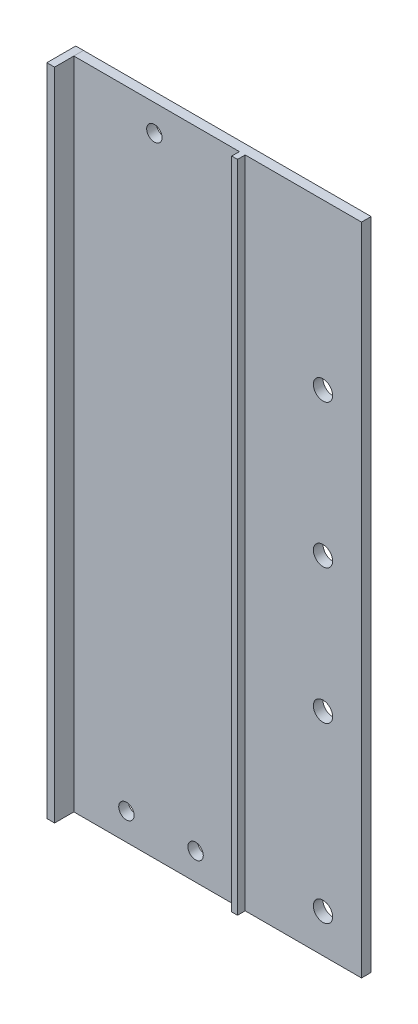
ISO-10303-21;
HEADER;
FILE_DESCRIPTION(('STEP AP214'),'2;1');
FILE_NAME('part.step','',(''),(''),'','','');
FILE_SCHEMA(('AUTOMOTIVE_DESIGN { 1 0 10303 214 1 1 1 1 }'));
ENDSEC;
DATA;
#1=APPLICATION_CONTEXT('core data for automotive mechanical design processes');
#2=APPLICATION_PROTOCOL_DEFINITION('international standard','automotive_design',2000,#1);
#3=PRODUCT_CONTEXT('',#1,'mechanical');
#4=PRODUCT('Part','Part','',(#3));
#5=PRODUCT_RELATED_PRODUCT_CATEGORY('part','',(#4));
#6=PRODUCT_DEFINITION_FORMATION('','',#4);
#7=PRODUCT_DEFINITION_CONTEXT('part definition',#1,'design');
#8=PRODUCT_DEFINITION('design','',#6,#7);
#9=PRODUCT_DEFINITION_SHAPE('','',#8);
#10=(LENGTH_UNIT() NAMED_UNIT(*) SI_UNIT(.MILLI.,.METRE.));
#11=(NAMED_UNIT(*) PLANE_ANGLE_UNIT() SI_UNIT($,.RADIAN.));
#12=(NAMED_UNIT(*) SI_UNIT($,.STERADIAN.) SOLID_ANGLE_UNIT());
#13=UNCERTAINTY_MEASURE_WITH_UNIT(LENGTH_MEASURE(1.E-05),#10,'distance_accuracy_value','');
#14=(GEOMETRIC_REPRESENTATION_CONTEXT(3) GLOBAL_UNCERTAINTY_ASSIGNED_CONTEXT((#13)) GLOBAL_UNIT_ASSIGNED_CONTEXT((#10,
#11,#12)) REPRESENTATION_CONTEXT('',''));
#15=CARTESIAN_POINT('',(0.,0.,0.));
#16=DIRECTION('',(0.,0.,1.));
#17=DIRECTION('',(1.,0.,0.));
#18=AXIS2_PLACEMENT_3D('',#15,#16,#17);
#19=CARTESIAN_POINT('',(-1.99999999999998,0.,7.5));
#20=DIRECTION('',(-1.,0.,0.));
#21=DIRECTION('',(0.,-1.,0.));
#22=AXIS2_PLACEMENT_3D('',#19,#20,#21);
#23=PLANE('',#22);
#24=DIRECTION('',(0.,1.,0.));
#25=VECTOR('',#24,1.);
#26=CARTESIAN_POINT('',(-1.99999999999998,0.,0.));
#27=LINE('',#26,#25);
#28=CARTESIAN_POINT('',(-1.99999999999998,0.,0.));
#29=VERTEX_POINT('',#28);
#30=CARTESIAN_POINT('',(-2.,170.,0.));
#31=VERTEX_POINT('',#30);
#32=EDGE_CURVE('E113',#29,#31,#27,.T.);
#33=ORIENTED_EDGE('',*,*,#32,.F.);
#34=DIRECTION('',(0.,0.,-1.));
#35=VECTOR('',#34,1.);
#36=CARTESIAN_POINT('',(-1.99999999999998,0.,7.5));
#37=LINE('',#36,#35);
#38=CARTESIAN_POINT('',(-1.99999999999998,0.,7.5));
#39=VERTEX_POINT('',#38);
#40=EDGE_CURVE('E12',#39,#29,#37,.T.);
#41=ORIENTED_EDGE('',*,*,#40,.F.);
#42=DIRECTION('',(0.,1.,0.));
#43=VECTOR('',#42,1.);
#44=CARTESIAN_POINT('',(-1.99999999999998,0.,7.5));
#45=LINE('',#44,#43);
#46=CARTESIAN_POINT('',(-2.,170.,7.5));
#47=VERTEX_POINT('',#46);
#48=EDGE_CURVE('E107',#39,#47,#45,.T.);
#49=ORIENTED_EDGE('',*,*,#48,.T.);
#50=DIRECTION('',(0.,0.,-1.));
#51=VECTOR('',#50,1.);
#52=CARTESIAN_POINT('',(-2.,170.,7.5));
#53=LINE('',#52,#51);
#54=EDGE_CURVE('E52',#47,#31,#53,.T.);
#55=ORIENTED_EDGE('',*,*,#54,.T.);
#56=EDGE_LOOP('',(#33,#41,#49,#55));
#57=FACE_BOUND('',#56,.T.);
#58=ADVANCED_FACE('F49',(#57),#23,.T.);
#59=CARTESIAN_POINT('',(0.,0.,7.5));
#60=DIRECTION('',(0.,-1.,0.));
#61=DIRECTION('',(1.,0.,0.));
#62=AXIS2_PLACEMENT_3D('',#59,#60,#61);
#63=PLANE('',#62);
#64=DIRECTION('',(-1.,0.,0.));
#65=VECTOR('',#64,1.);
#66=CARTESIAN_POINT('',(0.,0.,0.));
#67=LINE('',#66,#65);
#68=CARTESIAN_POINT('',(0.,0.,0.));
#69=VERTEX_POINT('',#68);
#70=EDGE_CURVE('E109',#69,#29,#67,.T.);
#71=ORIENTED_EDGE('',*,*,#70,.F.);
#72=DIRECTION('',(0.,0.,-1.));
#73=VECTOR('',#72,1.);
#74=CARTESIAN_POINT('',(0.,0.,7.5));
#75=LINE('',#74,#73);
#76=CARTESIAN_POINT('',(0.,0.,7.5));
#77=VERTEX_POINT('',#76);
#78=EDGE_CURVE('E58',#77,#69,#75,.T.);
#79=ORIENTED_EDGE('',*,*,#78,.F.);
#80=DIRECTION('',(-1.,0.,0.));
#81=VECTOR('',#80,1.);
#82=CARTESIAN_POINT('',(0.,0.,7.5));
#83=LINE('',#82,#81);
#84=EDGE_CURVE('E104',#77,#39,#83,.T.);
#85=ORIENTED_EDGE('',*,*,#84,.T.);
#86=ORIENTED_EDGE('',*,*,#40,.T.);
#87=EDGE_LOOP('',(#71,#79,#85,#86));
#88=FACE_BOUND('',#87,.T.);
#89=ADVANCED_FACE('F123',(#88),#63,.T.);
#90=CARTESIAN_POINT('',(0.,0.,7.5));
#91=DIRECTION('',(1.,0.,0.));
#92=DIRECTION('',(0.,0.,-1.));
#93=AXIS2_PLACEMENT_3D('',#90,#91,#92);
#94=PLANE('',#93);
#95=DIRECTION('',(0.,-1.,0.));
#96=VECTOR('',#95,1.);
#97=CARTESIAN_POINT('',(0.,0.,0.));
#98=LINE('',#97,#96);
#99=CARTESIAN_POINT('',(0.,170.,0.));
#100=VERTEX_POINT('',#99);
#101=EDGE_CURVE('E99',#100,#69,#98,.T.);
#102=ORIENTED_EDGE('',*,*,#101,.F.);
#103=DIRECTION('',(0.,0.,-1.));
#104=VECTOR('',#103,1.);
#105=CARTESIAN_POINT('',(0.,170.,7.5));
#106=LINE('',#105,#104);
#107=CARTESIAN_POINT('',(0.,170.,7.5));
#108=VERTEX_POINT('',#107);
#109=EDGE_CURVE('E94',#108,#100,#106,.T.);
#110=ORIENTED_EDGE('',*,*,#109,.F.);
#111=DIRECTION('',(0.,-1.,0.));
#112=VECTOR('',#111,1.);
#113=CARTESIAN_POINT('',(0.,0.,7.5));
#114=LINE('',#113,#112);
#115=EDGE_CURVE('E97',#108,#77,#114,.T.);
#116=ORIENTED_EDGE('',*,*,#115,.T.);
#117=ORIENTED_EDGE('',*,*,#78,.T.);
#118=EDGE_LOOP('',(#102,#110,#116,#117));
#119=FACE_BOUND('',#118,.T.);
#120=ADVANCED_FACE('F96',(#119),#94,.T.);
#121=CARTESIAN_POINT('',(0.,170.,7.5));
#122=DIRECTION('',(0.,1.,0.));
#123=DIRECTION('',(0.,0.,1.));
#124=AXIS2_PLACEMENT_3D('',#121,#122,#123);
#125=PLANE('',#124);
#126=DIRECTION('',(1.,0.,0.));
#127=VECTOR('',#126,1.);
#128=CARTESIAN_POINT('',(0.,170.,0.));
#129=LINE('',#128,#127);
#130=EDGE_CURVE('E116',#31,#100,#129,.T.);
#131=ORIENTED_EDGE('',*,*,#130,.F.);
#132=ORIENTED_EDGE('',*,*,#54,.F.);
#133=DIRECTION('',(1.,0.,0.));
#134=VECTOR('',#133,1.);
#135=CARTESIAN_POINT('',(0.,170.,7.5));
#136=LINE('',#135,#134);
#137=EDGE_CURVE('E103',#47,#108,#136,.T.);
#138=ORIENTED_EDGE('',*,*,#137,.T.);
#139=ORIENTED_EDGE('',*,*,#109,.T.);
#140=EDGE_LOOP('',(#131,#132,#138,#139));
#141=FACE_BOUND('',#140,.T.);
#142=ADVANCED_FACE('F106',(#141),#125,.T.);
#143=CARTESIAN_POINT('',(0.,0.,7.5));
#144=DIRECTION('',(0.,0.,-1.));
#145=DIRECTION('',(-1.,0.,0.));
#146=AXIS2_PLACEMENT_3D('',#143,#144,#145);
#147=PLANE('',#146);
#148=ORIENTED_EDGE('',*,*,#48,.F.);
#149=ORIENTED_EDGE('',*,*,#84,.F.);
#150=ORIENTED_EDGE('',*,*,#115,.F.);
#151=ORIENTED_EDGE('',*,*,#137,.F.);
#152=EDGE_LOOP('',(#148,#149,#150,#151));
#153=FACE_BOUND('',#152,.T.);
#154=ADVANCED_FACE('F102',(#153),#147,.F.);
#155=CARTESIAN_POINT('',(0.,0.,0.));
#156=DIRECTION('',(0.,0.,-1.));
#157=DIRECTION('',(-1.,0.,0.));
#158=AXIS2_PLACEMENT_3D('',#155,#156,#157);
#159=PLANE('',#158);
#160=ORIENTED_EDGE('',*,*,#32,.T.);
#161=ORIENTED_EDGE('',*,*,#130,.T.);
#162=ORIENTED_EDGE('',*,*,#101,.T.);
#163=ORIENTED_EDGE('',*,*,#70,.T.);
#164=EDGE_LOOP('',(#160,#161,#162,#163));
#165=FACE_BOUND('',#164,.T.);
#166=ADVANCED_FACE('F122',(#165),#159,.T.);
#167=CLOSED_SHELL('',(#58,#89,#120,#142,#154,#166));
#168=MANIFOLD_SOLID_BREP('B2',#167);
#169=CARTESIAN_POINT('',(0.,0.,2.5));
#170=DIRECTION('',(0.,0.,-1.));
#171=DIRECTION('',(-1.,0.,0.));
#172=AXIS2_PLACEMENT_3D('',#169,#170,#171);
#173=PLANE('',#172);
#174=CARTESIAN_POINT('',(13.6515942444387,7.02126150728162,2.5));
#175=DIRECTION('',(0.,0.,1.));
#176=DIRECTION('',(1.,0.,0.));
#177=AXIS2_PLACEMENT_3D('',#174,#175,#176);
#178=CIRCLE('',#177,2.);
#179=CARTESIAN_POINT('',(15.6515942444387,7.02126150728162,2.5));
#180=VERTEX_POINT('',#179);
#181=EDGE_CURVE('E311',#180,#180,#178,.T.);
#182=ORIENTED_EDGE('',*,*,#181,.F.);
#183=EDGE_LOOP('',(#182));
#184=FACE_BOUND('',#183,.T.);
#185=CARTESIAN_POINT('',(31.6132585895672,7.02126150728162,2.5));
#186=DIRECTION('',(0.,0.,1.));
#187=DIRECTION('',(1.,0.,0.));
#188=AXIS2_PLACEMENT_3D('',#185,#186,#187);
#189=CIRCLE('',#188,2.);
#190=CARTESIAN_POINT('',(33.6132585895672,7.02126150728162,2.5));
#191=VERTEX_POINT('',#190);
#192=EDGE_CURVE('E319',#191,#191,#189,.T.);
#193=ORIENTED_EDGE('',*,*,#192,.F.);
#194=EDGE_LOOP('',(#193));
#195=FACE_BOUND('',#194,.T.);
#196=CARTESIAN_POINT('',(20.913881882093,163.093745051864,2.5));
#197=DIRECTION('',(0.,0.,1.));
#198=DIRECTION('',(1.,0.,0.));
#199=AXIS2_PLACEMENT_3D('',#196,#197,#198);
#200=CIRCLE('',#199,2.);
#201=CARTESIAN_POINT('',(22.913881882093,163.093745051864,2.5));
#202=VERTEX_POINT('',#201);
#203=EDGE_CURVE('E327',#202,#202,#200,.T.);
#204=ORIENTED_EDGE('',*,*,#203,.F.);
#205=EDGE_LOOP('',(#204));
#206=FACE_BOUND('',#205,.T.);
#207=DIRECTION('',(0.,-1.,0.));
#208=VECTOR('',#207,1.);
#209=CARTESIAN_POINT('',(43.,170.,2.5));
#210=LINE('',#209,#208);
#211=CARTESIAN_POINT('',(43.,170.,2.5));
#212=VERTEX_POINT('',#211);
#213=CARTESIAN_POINT('',(43.,0.,2.5));
#214=VERTEX_POINT('',#213);
#215=EDGE_CURVE('E190',#212,#214,#210,.T.);
#216=ORIENTED_EDGE('',*,*,#215,.F.);
#217=DIRECTION('',(-1.,0.,0.));
#218=VECTOR('',#217,1.);
#219=CARTESIAN_POINT('',(0.,170.,2.5));
#220=LINE('',#219,#218);
#221=CARTESIAN_POINT('',(0.,170.,2.5));
#222=VERTEX_POINT('',#221);
#223=EDGE_CURVE('E347',#212,#222,#220,.T.);
#224=ORIENTED_EDGE('',*,*,#223,.T.);
#225=DIRECTION('',(0.,-1.,0.));
#226=VECTOR('',#225,1.);
#227=CARTESIAN_POINT('',(0.,0.,2.5));
#228=LINE('',#227,#226);
#229=CARTESIAN_POINT('',(0.,0.,2.5));
#230=VERTEX_POINT('',#229);
#231=EDGE_CURVE('E335',#222,#230,#228,.T.);
#232=ORIENTED_EDGE('',*,*,#231,.T.);
#233=DIRECTION('',(1.,0.,0.));
#234=VECTOR('',#233,1.);
#235=CARTESIAN_POINT('',(0.,0.,2.5));
#236=LINE('',#235,#234);
#237=EDGE_CURVE('E341',#230,#214,#236,.T.);
#238=ORIENTED_EDGE('',*,*,#237,.T.);
#239=EDGE_LOOP('',(#216,#224,#232,#238));
#240=FACE_BOUND('',#239,.T.);
#241=ADVANCED_FACE('F173',(#184,#195,#206,#240),#173,.F.);
#242=CARTESIAN_POINT('',(64.7,127.25,2.5));
#243=DIRECTION('',(0.,0.,1.));
#244=DIRECTION('',(1.,0.,0.));
#245=AXIS2_PLACEMENT_3D('',#242,#243,#244);
#246=CIRCLE('',#245,2.5);
#247=CARTESIAN_POINT('',(67.2,127.25,2.5));
#248=VERTEX_POINT('',#247);
#249=EDGE_CURVE('E270',#248,#248,#246,.T.);
#250=ORIENTED_EDGE('',*,*,#249,.F.);
#251=EDGE_LOOP('',(#250));
#252=FACE_BOUND('',#251,.T.);
#253=CARTESIAN_POINT('',(64.7,10.,2.5));
#254=DIRECTION('',(0.,0.,-1.));
#255=DIRECTION('',(-1.,0.,0.));
#256=AXIS2_PLACEMENT_3D('',#253,#254,#255);
#257=CIRCLE('',#256,2.5);
#258=CARTESIAN_POINT('',(62.2,10.,2.5));
#259=VERTEX_POINT('',#258);
#260=EDGE_CURVE('E306',#259,#259,#257,.T.);
#261=ORIENTED_EDGE('',*,*,#260,.T.);
#262=EDGE_LOOP('',(#261));
#263=FACE_BOUND('',#262,.T.);
#264=CARTESIAN_POINT('',(64.7,55.,2.5));
#265=DIRECTION('',(0.,0.,-1.));
#266=DIRECTION('',(-1.,0.,0.));
#267=AXIS2_PLACEMENT_3D('',#264,#265,#266);
#268=CIRCLE('',#267,2.5);
#269=CARTESIAN_POINT('',(62.2,55.,2.5));
#270=VERTEX_POINT('',#269);
#271=EDGE_CURVE('E302',#270,#270,#268,.T.);
#272=ORIENTED_EDGE('',*,*,#271,.T.);
#273=EDGE_LOOP('',(#272));
#274=FACE_BOUND('',#273,.T.);
#275=CARTESIAN_POINT('',(64.7,90.,2.5));
#276=DIRECTION('',(0.,0.,-1.));
#277=DIRECTION('',(-1.,0.,0.));
#278=AXIS2_PLACEMENT_3D('',#275,#276,#277);
#279=CIRCLE('',#278,2.5);
#280=CARTESIAN_POINT('',(62.2,90.,2.5));
#281=VERTEX_POINT('',#280);
#282=EDGE_CURVE('E291',#281,#281,#279,.T.);
#283=ORIENTED_EDGE('',*,*,#282,.T.);
#284=EDGE_LOOP('',(#283));
#285=FACE_BOUND('',#284,.T.);
#286=CARTESIAN_POINT('',(74.7,170.,2.5));
#287=VERTEX_POINT('',#286);
#288=CARTESIAN_POINT('',(44.5,170.,2.5));
#289=VERTEX_POINT('',#288);
#290=EDGE_CURVE('E198',#287,#289,#220,.T.);
#291=ORIENTED_EDGE('',*,*,#290,.T.);
#292=DIRECTION('',(0.,-1.,0.));
#293=VECTOR('',#292,1.);
#294=CARTESIAN_POINT('',(44.5,170.,2.5));
#295=LINE('',#294,#293);
#296=CARTESIAN_POINT('',(44.5,0.,2.5));
#297=VERTEX_POINT('',#296);
#298=EDGE_CURVE('E245',#289,#297,#295,.T.);
#299=ORIENTED_EDGE('',*,*,#298,.T.);
#300=CARTESIAN_POINT('',(74.7,0.,2.5));
#301=VERTEX_POINT('',#300);
#302=EDGE_CURVE('E339',#297,#301,#236,.T.);
#303=ORIENTED_EDGE('',*,*,#302,.T.);
#304=DIRECTION('',(0.,1.,0.));
#305=VECTOR('',#304,1.);
#306=CARTESIAN_POINT('',(74.7,0.,2.5));
#307=LINE('',#306,#305);
#308=EDGE_CURVE('E344',#301,#287,#307,.T.);
#309=ORIENTED_EDGE('',*,*,#308,.T.);
#310=EDGE_LOOP('',(#291,#299,#303,#309));
#311=FACE_BOUND('',#310,.T.);
#312=ADVANCED_FACE('F390',(#252,#263,#274,#285,#311),#173,.F.);
#313=CARTESIAN_POINT('',(0.,0.,0.));
#314=DIRECTION('',(0.,0.,-1.));
#315=DIRECTION('',(-1.,0.,0.));
#316=AXIS2_PLACEMENT_3D('',#313,#314,#315);
#317=PLANE('',#316);
#318=CARTESIAN_POINT('',(64.7,127.25,0.));
#319=DIRECTION('',(0.,0.,-1.));
#320=DIRECTION('',(-1.,0.,0.));
#321=AXIS2_PLACEMENT_3D('',#318,#319,#320);
#322=CIRCLE('',#321,2.5);
#323=CARTESIAN_POINT('',(62.2,127.25,0.));
#324=VERTEX_POINT('',#323);
#325=EDGE_CURVE('E177',#324,#324,#322,.T.);
#326=ORIENTED_EDGE('',*,*,#325,.F.);
#327=EDGE_LOOP('',(#326));
#328=FACE_BOUND('',#327,.T.);
#329=CARTESIAN_POINT('',(64.7,10.,0.));
#330=DIRECTION('',(0.,0.,-1.));
#331=DIRECTION('',(-1.,0.,0.));
#332=AXIS2_PLACEMENT_3D('',#329,#330,#331);
#333=CIRCLE('',#332,2.5);
#334=CARTESIAN_POINT('',(62.2,10.,0.));
#335=VERTEX_POINT('',#334);
#336=EDGE_CURVE('E287',#335,#335,#333,.T.);
#337=ORIENTED_EDGE('',*,*,#336,.F.);
#338=EDGE_LOOP('',(#337));
#339=FACE_BOUND('',#338,.T.);
#340=CARTESIAN_POINT('',(64.7,55.,0.));
#341=DIRECTION('',(0.,0.,-1.));
#342=DIRECTION('',(-1.,0.,0.));
#343=AXIS2_PLACEMENT_3D('',#340,#341,#342);
#344=CIRCLE('',#343,2.5);
#345=CARTESIAN_POINT('',(62.2,55.,0.));
#346=VERTEX_POINT('',#345);
#347=EDGE_CURVE('E292',#346,#346,#344,.T.);
#348=ORIENTED_EDGE('',*,*,#347,.F.);
#349=EDGE_LOOP('',(#348));
#350=FACE_BOUND('',#349,.T.);
#351=CARTESIAN_POINT('',(64.7,90.,0.));
#352=DIRECTION('',(0.,0.,-1.));
#353=DIRECTION('',(-1.,0.,0.));
#354=AXIS2_PLACEMENT_3D('',#351,#352,#353);
#355=CIRCLE('',#354,2.5);
#356=CARTESIAN_POINT('',(62.2,90.,0.));
#357=VERTEX_POINT('',#356);
#358=EDGE_CURVE('E280',#357,#357,#355,.T.);
#359=ORIENTED_EDGE('',*,*,#358,.F.);
#360=EDGE_LOOP('',(#359));
#361=FACE_BOUND('',#360,.T.);
#362=CARTESIAN_POINT('',(31.6132585895672,7.02126150728162,0.));
#363=DIRECTION('',(0.,0.,1.));
#364=DIRECTION('',(1.,0.,0.));
#365=AXIS2_PLACEMENT_3D('',#362,#363,#364);
#366=CIRCLE('',#365,2.);
#367=CARTESIAN_POINT('',(33.6132585895672,7.02126150728162,0.));
#368=VERTEX_POINT('',#367);
#369=EDGE_CURVE('E315',#368,#368,#366,.T.);
#370=ORIENTED_EDGE('',*,*,#369,.T.);
#371=EDGE_LOOP('',(#370));
#372=FACE_BOUND('',#371,.T.);
#373=DIRECTION('',(0.,-1.,0.));
#374=VECTOR('',#373,1.);
#375=CARTESIAN_POINT('',(0.,0.,0.));
#376=LINE('',#375,#374);
#377=CARTESIAN_POINT('',(0.,170.,0.));
#378=VERTEX_POINT('',#377);
#379=CARTESIAN_POINT('',(0.,0.,0.));
#380=VERTEX_POINT('',#379);
#381=EDGE_CURVE('E331',#378,#380,#376,.T.);
#382=ORIENTED_EDGE('',*,*,#381,.F.);
#383=DIRECTION('',(-1.,0.,0.));
#384=VECTOR('',#383,1.);
#385=CARTESIAN_POINT('',(0.,170.,0.));
#386=LINE('',#385,#384);
#387=CARTESIAN_POINT('',(74.7,170.,0.));
#388=VERTEX_POINT('',#387);
#389=EDGE_CURVE('E340',#388,#378,#386,.T.);
#390=ORIENTED_EDGE('',*,*,#389,.F.);
#391=DIRECTION('',(0.,1.,0.));
#392=VECTOR('',#391,1.);
#393=CARTESIAN_POINT('',(74.7,0.,0.));
#394=LINE('',#393,#392);
#395=CARTESIAN_POINT('',(74.7,0.,0.));
#396=VERTEX_POINT('',#395);
#397=EDGE_CURVE('E357',#396,#388,#394,.T.);
#398=ORIENTED_EDGE('',*,*,#397,.F.);
#399=DIRECTION('',(1.,0.,0.));
#400=VECTOR('',#399,1.);
#401=CARTESIAN_POINT('',(0.,0.,0.));
#402=LINE('',#401,#400);
#403=EDGE_CURVE('E354',#380,#396,#402,.T.);
#404=ORIENTED_EDGE('',*,*,#403,.F.);
#405=EDGE_LOOP('',(#382,#390,#398,#404));
#406=FACE_BOUND('',#405,.T.);
#407=CARTESIAN_POINT('',(20.913881882093,163.093745051864,0.));
#408=DIRECTION('',(0.,0.,1.));
#409=DIRECTION('',(1.,0.,0.));
#410=AXIS2_PLACEMENT_3D('',#407,#408,#409);
#411=CIRCLE('',#410,2.);
#412=CARTESIAN_POINT('',(22.913881882093,163.093745051864,0.));
#413=VERTEX_POINT('',#412);
#414=EDGE_CURVE('E323',#413,#413,#411,.T.);
#415=ORIENTED_EDGE('',*,*,#414,.T.);
#416=EDGE_LOOP('',(#415));
#417=FACE_BOUND('',#416,.T.);
#418=CARTESIAN_POINT('',(13.6515942444387,7.02126150728162,0.));
#419=DIRECTION('',(0.,0.,1.));
#420=DIRECTION('',(1.,0.,0.));
#421=AXIS2_PLACEMENT_3D('',#418,#419,#420);
#422=CIRCLE('',#421,2.);
#423=CARTESIAN_POINT('',(15.6515942444387,7.02126150728162,0.));
#424=VERTEX_POINT('',#423);
#425=EDGE_CURVE('E310',#424,#424,#422,.T.);
#426=ORIENTED_EDGE('',*,*,#425,.T.);
#427=EDGE_LOOP('',(#426));
#428=FACE_BOUND('',#427,.T.);
#429=ADVANCED_FACE('F382',(#328,#339,#350,#361,#372,#406,#417,#428),#317,.T.);
#430=CARTESIAN_POINT('',(0.,0.,2.5));
#431=DIRECTION('',(1.,0.,0.));
#432=DIRECTION('',(0.,0.,-1.));
#433=AXIS2_PLACEMENT_3D('',#430,#431,#432);
#434=PLANE('',#433);
#435=ORIENTED_EDGE('',*,*,#381,.T.);
#436=DIRECTION('',(0.,0.,-1.));
#437=VECTOR('',#436,1.);
#438=CARTESIAN_POINT('',(0.,0.,2.5));
#439=LINE('',#438,#437);
#440=EDGE_CURVE('E47',#230,#380,#439,.T.);
#441=ORIENTED_EDGE('',*,*,#440,.F.);
#442=ORIENTED_EDGE('',*,*,#231,.F.);
#443=DIRECTION('',(0.,0.,-1.));
#444=VECTOR('',#443,1.);
#445=CARTESIAN_POINT('',(0.,170.,2.5));
#446=LINE('',#445,#444);
#447=EDGE_CURVE('E350',#222,#378,#446,.T.);
#448=ORIENTED_EDGE('',*,*,#447,.T.);
#449=EDGE_LOOP('',(#435,#441,#442,#448));
#450=FACE_BOUND('',#449,.T.);
#451=ADVANCED_FACE('F175',(#450),#434,.F.);
#452=CARTESIAN_POINT('',(0.,0.,2.5));
#453=DIRECTION('',(0.,1.,0.));
#454=DIRECTION('',(0.,0.,1.));
#455=AXIS2_PLACEMENT_3D('',#452,#453,#454);
#456=PLANE('',#455);
#457=ORIENTED_EDGE('',*,*,#403,.T.);
#458=DIRECTION('',(0.,0.,-1.));
#459=VECTOR('',#458,1.);
#460=CARTESIAN_POINT('',(74.7,0.,2.5));
#461=LINE('',#460,#459);
#462=EDGE_CURVE('E183',#301,#396,#461,.T.);
#463=ORIENTED_EDGE('',*,*,#462,.F.);
#464=ORIENTED_EDGE('',*,*,#302,.F.);
#465=DIRECTION('',(0.,0.,-1.));
#466=VECTOR('',#465,1.);
#467=CARTESIAN_POINT('',(44.5,0.,4.5));
#468=LINE('',#467,#466);
#469=CARTESIAN_POINT('',(44.5,0.,4.5));
#470=VERTEX_POINT('',#469);
#471=EDGE_CURVE('E249',#470,#297,#468,.T.);
#472=ORIENTED_EDGE('',*,*,#471,.F.);
#473=DIRECTION('',(1.,0.,0.));
#474=VECTOR('',#473,1.);
#475=CARTESIAN_POINT('',(43.,0.,4.5));
#476=LINE('',#475,#474);
#477=CARTESIAN_POINT('',(43.,0.,4.5));
#478=VERTEX_POINT('',#477);
#479=EDGE_CURVE('E257',#478,#470,#476,.T.);
#480=ORIENTED_EDGE('',*,*,#479,.F.);
#481=DIRECTION('',(0.,0.,-1.));
#482=VECTOR('',#481,1.);
#483=CARTESIAN_POINT('',(43.,0.,4.5));
#484=LINE('',#483,#482);
#485=EDGE_CURVE('E281',#478,#214,#484,.T.);
#486=ORIENTED_EDGE('',*,*,#485,.T.);
#487=ORIENTED_EDGE('',*,*,#237,.F.);
#488=ORIENTED_EDGE('',*,*,#440,.T.);
#489=EDGE_LOOP('',(#457,#463,#464,#472,#480,#486,#487,#488));
#490=FACE_BOUND('',#489,.T.);
#491=ADVANCED_FACE('F391',(#490),#456,.F.);
#492=CARTESIAN_POINT('',(74.7,0.,2.5));
#493=DIRECTION('',(-1.,0.,0.));
#494=DIRECTION('',(0.,0.,1.));
#495=AXIS2_PLACEMENT_3D('',#492,#493,#494);
#496=PLANE('',#495);
#497=ORIENTED_EDGE('',*,*,#397,.T.);
#498=DIRECTION('',(0.,0.,-1.));
#499=VECTOR('',#498,1.);
#500=CARTESIAN_POINT('',(74.7,170.,2.5));
#501=LINE('',#500,#499);
#502=EDGE_CURVE('E365',#287,#388,#501,.T.);
#503=ORIENTED_EDGE('',*,*,#502,.F.);
#504=ORIENTED_EDGE('',*,*,#308,.F.);
#505=ORIENTED_EDGE('',*,*,#462,.T.);
#506=EDGE_LOOP('',(#497,#503,#504,#505));
#507=FACE_BOUND('',#506,.T.);
#508=ADVANCED_FACE('F375',(#507),#496,.F.);
#509=CARTESIAN_POINT('',(0.,170.,2.5));
#510=DIRECTION('',(0.,-1.,0.));
#511=DIRECTION('',(0.,0.,-1.));
#512=AXIS2_PLACEMENT_3D('',#509,#510,#511);
#513=PLANE('',#512);
#514=ORIENTED_EDGE('',*,*,#389,.T.);
#515=ORIENTED_EDGE('',*,*,#447,.F.);
#516=ORIENTED_EDGE('',*,*,#223,.F.);
#517=DIRECTION('',(0.,0.,-1.));
#518=VECTOR('',#517,1.);
#519=CARTESIAN_POINT('',(43.,170.,4.5));
#520=LINE('',#519,#518);
#521=CARTESIAN_POINT('',(43.,170.,4.5));
#522=VERTEX_POINT('',#521);
#523=EDGE_CURVE('E263',#522,#212,#520,.T.);
#524=ORIENTED_EDGE('',*,*,#523,.F.);
#525=DIRECTION('',(1.,0.,0.));
#526=VECTOR('',#525,1.);
#527=CARTESIAN_POINT('',(43.,170.,4.5));
#528=LINE('',#527,#526);
#529=CARTESIAN_POINT('',(44.5,170.,4.5));
#530=VERTEX_POINT('',#529);
#531=EDGE_CURVE('E255',#522,#530,#528,.T.);
#532=ORIENTED_EDGE('',*,*,#531,.T.);
#533=DIRECTION('',(0.,0.,-1.));
#534=VECTOR('',#533,1.);
#535=CARTESIAN_POINT('',(44.5,170.,4.5));
#536=LINE('',#535,#534);
#537=EDGE_CURVE('E240',#530,#289,#536,.T.);
#538=ORIENTED_EDGE('',*,*,#537,.T.);
#539=ORIENTED_EDGE('',*,*,#290,.F.);
#540=ORIENTED_EDGE('',*,*,#502,.T.);
#541=EDGE_LOOP('',(#514,#515,#516,#524,#532,#538,#539,#540));
#542=FACE_BOUND('',#541,.T.);
#543=ADVANCED_FACE('F261',(#542),#513,.F.);
#544=CARTESIAN_POINT('',(20.913881882093,163.093745051864,2.5));
#545=DIRECTION('',(0.,0.,-1.));
#546=DIRECTION('',(-1.,0.,0.));
#547=AXIS2_PLACEMENT_3D('',#544,#545,#546);
#548=CYLINDRICAL_SURFACE('',#547,2.);
#549=ORIENTED_EDGE('',*,*,#203,.T.);
#550=EDGE_LOOP('',(#549));
#551=FACE_BOUND('',#550,.T.);
#552=ORIENTED_EDGE('',*,*,#414,.F.);
#553=EDGE_LOOP('',(#552));
#554=FACE_BOUND('',#553,.T.);
#555=ADVANCED_FACE('F418',(#551,#554),#548,.F.);
#556=CARTESIAN_POINT('',(31.6132585895672,7.02126150728162,2.5));
#557=DIRECTION('',(0.,0.,-1.));
#558=DIRECTION('',(-1.,0.,0.));
#559=AXIS2_PLACEMENT_3D('',#556,#557,#558);
#560=CYLINDRICAL_SURFACE('',#559,2.);
#561=ORIENTED_EDGE('',*,*,#192,.T.);
#562=EDGE_LOOP('',(#561));
#563=FACE_BOUND('',#562,.T.);
#564=ORIENTED_EDGE('',*,*,#369,.F.);
#565=EDGE_LOOP('',(#564));
#566=FACE_BOUND('',#565,.T.);
#567=ADVANCED_FACE('F514',(#563,#566),#560,.F.);
#568=CARTESIAN_POINT('',(13.6515942444387,7.02126150728162,2.5));
#569=DIRECTION('',(0.,0.,-1.));
#570=DIRECTION('',(-1.,0.,0.));
#571=AXIS2_PLACEMENT_3D('',#568,#569,#570);
#572=CYLINDRICAL_SURFACE('',#571,2.);
#573=ORIENTED_EDGE('',*,*,#181,.T.);
#574=EDGE_LOOP('',(#573));
#575=FACE_BOUND('',#574,.T.);
#576=ORIENTED_EDGE('',*,*,#425,.F.);
#577=EDGE_LOOP('',(#576));
#578=FACE_BOUND('',#577,.T.);
#579=ADVANCED_FACE('F504',(#575,#578),#572,.F.);
#580=CARTESIAN_POINT('',(64.7,90.,5.));
#581=DIRECTION('',(0.,0.,-1.));
#582=DIRECTION('',(-1.,0.,0.));
#583=AXIS2_PLACEMENT_3D('',#580,#581,#582);
#584=CYLINDRICAL_SURFACE('',#583,2.5);
#585=ORIENTED_EDGE('',*,*,#358,.T.);
#586=EDGE_LOOP('',(#585));
#587=FACE_BOUND('',#586,.T.);
#588=ORIENTED_EDGE('',*,*,#282,.F.);
#589=EDGE_LOOP('',(#588));
#590=FACE_BOUND('',#589,.T.);
#591=ADVANCED_FACE('F494',(#587,#590),#584,.F.);
#592=CARTESIAN_POINT('',(64.7,55.,5.));
#593=DIRECTION('',(0.,0.,-1.));
#594=DIRECTION('',(-1.,0.,0.));
#595=AXIS2_PLACEMENT_3D('',#592,#593,#594);
#596=CYLINDRICAL_SURFACE('',#595,2.5);
#597=ORIENTED_EDGE('',*,*,#347,.T.);
#598=EDGE_LOOP('',(#597));
#599=FACE_BOUND('',#598,.T.);
#600=ORIENTED_EDGE('',*,*,#271,.F.);
#601=EDGE_LOOP('',(#600));
#602=FACE_BOUND('',#601,.T.);
#603=ADVANCED_FACE('F403',(#599,#602),#596,.F.);
#604=CARTESIAN_POINT('',(64.7,10.,5.));
#605=DIRECTION('',(0.,0.,-1.));
#606=DIRECTION('',(-1.,0.,0.));
#607=AXIS2_PLACEMENT_3D('',#604,#605,#606);
#608=CYLINDRICAL_SURFACE('',#607,2.5);
#609=ORIENTED_EDGE('',*,*,#336,.T.);
#610=EDGE_LOOP('',(#609));
#611=FACE_BOUND('',#610,.T.);
#612=ORIENTED_EDGE('',*,*,#260,.F.);
#613=EDGE_LOOP('',(#612));
#614=FACE_BOUND('',#613,.T.);
#615=ADVANCED_FACE('F396',(#611,#614),#608,.F.);
#616=CARTESIAN_POINT('',(43.,170.,4.5));
#617=DIRECTION('',(1.,0.,0.));
#618=DIRECTION('',(0.,0.,-1.));
#619=AXIS2_PLACEMENT_3D('',#616,#617,#618);
#620=PLANE('',#619);
#621=ORIENTED_EDGE('',*,*,#215,.T.);
#622=ORIENTED_EDGE('',*,*,#485,.F.);
#623=DIRECTION('',(0.,-1.,0.));
#624=VECTOR('',#623,1.);
#625=CARTESIAN_POINT('',(43.,170.,4.5));
#626=LINE('',#625,#624);
#627=EDGE_CURVE('E250',#522,#478,#626,.T.);
#628=ORIENTED_EDGE('',*,*,#627,.F.);
#629=ORIENTED_EDGE('',*,*,#523,.T.);
#630=EDGE_LOOP('',(#621,#622,#628,#629));
#631=FACE_BOUND('',#630,.T.);
#632=ADVANCED_FACE('F394',(#631),#620,.F.);
#633=CARTESIAN_POINT('',(44.5,170.,4.5));
#634=DIRECTION('',(1.,0.,0.));
#635=DIRECTION('',(0.,1.,0.));
#636=AXIS2_PLACEMENT_3D('',#633,#634,#635);
#637=PLANE('',#636);
#638=ORIENTED_EDGE('',*,*,#298,.F.);
#639=ORIENTED_EDGE('',*,*,#537,.F.);
#640=DIRECTION('',(0.,-1.,0.));
#641=VECTOR('',#640,1.);
#642=CARTESIAN_POINT('',(44.5,170.,4.5));
#643=LINE('',#642,#641);
#644=EDGE_CURVE('E244',#530,#470,#643,.T.);
#645=ORIENTED_EDGE('',*,*,#644,.T.);
#646=ORIENTED_EDGE('',*,*,#471,.T.);
#647=EDGE_LOOP('',(#638,#639,#645,#646));
#648=FACE_BOUND('',#647,.T.);
#649=ADVANCED_FACE('F242',(#648),#637,.T.);
#650=CARTESIAN_POINT('',(0.,0.,4.5));
#651=DIRECTION('',(0.,0.,-1.));
#652=DIRECTION('',(-1.,0.,0.));
#653=AXIS2_PLACEMENT_3D('',#650,#651,#652);
#654=PLANE('',#653);
#655=ORIENTED_EDGE('',*,*,#531,.F.);
#656=ORIENTED_EDGE('',*,*,#627,.T.);
#657=ORIENTED_EDGE('',*,*,#479,.T.);
#658=ORIENTED_EDGE('',*,*,#644,.F.);
#659=EDGE_LOOP('',(#655,#656,#657,#658));
#660=FACE_BOUND('',#659,.T.);
#661=ADVANCED_FACE('F254',(#660),#654,.F.);
#662=CARTESIAN_POINT('',(64.7,127.25,-9.5));
#663=DIRECTION('',(0.,0.,1.));
#664=DIRECTION('',(1.,0.,0.));
#665=AXIS2_PLACEMENT_3D('',#662,#663,#664);
#666=CYLINDRICAL_SURFACE('',#665,2.5);
#667=ORIENTED_EDGE('',*,*,#325,.T.);
#668=EDGE_LOOP('',(#667));
#669=FACE_BOUND('',#668,.T.);
#670=ORIENTED_EDGE('',*,*,#249,.T.);
#671=EDGE_LOOP('',(#670));
#672=FACE_BOUND('',#671,.T.);
#673=ADVANCED_FACE('F451',(#669,#672),#666,.F.);
#674=CLOSED_SHELL('',(#241,#312,#429,#451,#491,#508,#543,#555,#567,#579,#591,#603,#615,#632,
#649,#661,#673));
#675=MANIFOLD_SOLID_BREP('B6',#674);
#676=ADVANCED_BREP_SHAPE_REPRESENTATION('',(#18,#168,#675),#14);
#677=SHAPE_DEFINITION_REPRESENTATION(#9,#676);
ENDSEC;
END-ISO-10303-21;
